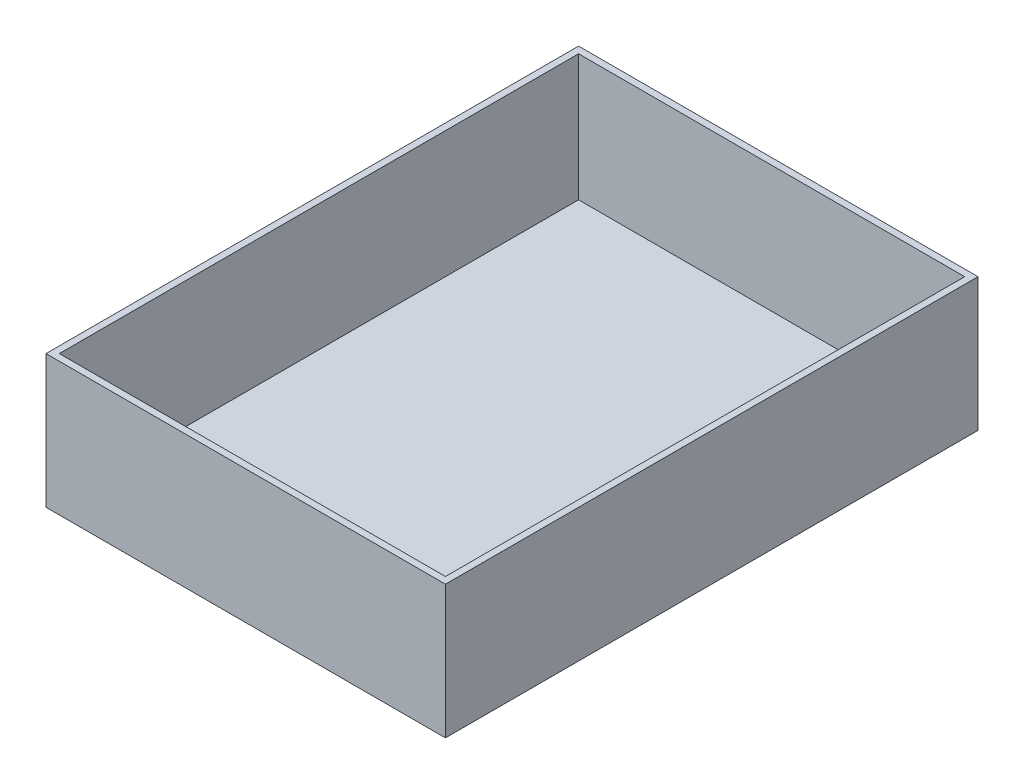
ISO-10303-21;
HEADER;
FILE_DESCRIPTION(('STEP AP214'),'2;1');
FILE_NAME('part.step','',(''),(''),'','','');
FILE_SCHEMA(('AUTOMOTIVE_DESIGN { 1 0 10303 214 1 1 1 1 }'));
ENDSEC;
DATA;
#1=APPLICATION_CONTEXT('core data for automotive mechanical design processes');
#2=APPLICATION_PROTOCOL_DEFINITION('international standard','automotive_design',2000,#1);
#3=PRODUCT_CONTEXT('',#1,'mechanical');
#4=PRODUCT('Part','Part','',(#3));
#5=PRODUCT_RELATED_PRODUCT_CATEGORY('part','',(#4));
#6=PRODUCT_DEFINITION_FORMATION('','',#4);
#7=PRODUCT_DEFINITION_CONTEXT('part definition',#1,'design');
#8=PRODUCT_DEFINITION('design','',#6,#7);
#9=PRODUCT_DEFINITION_SHAPE('','',#8);
#10=(LENGTH_UNIT() NAMED_UNIT(*) SI_UNIT(.MILLI.,.METRE.));
#11=(NAMED_UNIT(*) PLANE_ANGLE_UNIT() SI_UNIT($,.RADIAN.));
#12=(NAMED_UNIT(*) SI_UNIT($,.STERADIAN.) SOLID_ANGLE_UNIT());
#13=UNCERTAINTY_MEASURE_WITH_UNIT(LENGTH_MEASURE(1.E-05),#10,'distance_accuracy_value','');
#14=(GEOMETRIC_REPRESENTATION_CONTEXT(3) GLOBAL_UNCERTAINTY_ASSIGNED_CONTEXT((#13)) GLOBAL_UNIT_ASSIGNED_CONTEXT((#10,
#11,#12)) REPRESENTATION_CONTEXT('',''));
#15=CARTESIAN_POINT('',(0.,0.,0.));
#16=DIRECTION('',(0.,0.,1.));
#17=DIRECTION('',(1.,0.,0.));
#18=AXIS2_PLACEMENT_3D('',#15,#16,#17);
#19=CARTESIAN_POINT('',(75.,-25.,-200.));
#20=DIRECTION('',(1.,0.,0.));
#21=DIRECTION('',(0.,0.,-1.));
#22=AXIS2_PLACEMENT_3D('',#19,#20,#21);
#23=PLANE('',#22);
#24=DIRECTION('',(0.,1.,0.));
#25=VECTOR('',#24,1.);
#26=CARTESIAN_POINT('',(75.,-25.,0.));
#27=LINE('',#26,#25);
#28=CARTESIAN_POINT('',(75.,-25.,0.));
#29=VERTEX_POINT('',#28);
#30=CARTESIAN_POINT('',(75.,25.,0.));
#31=VERTEX_POINT('',#30);
#32=EDGE_CURVE('E142',#29,#31,#27,.T.);
#33=ORIENTED_EDGE('',*,*,#32,.F.);
#34=DIRECTION('',(0.,0.,1.));
#35=VECTOR('',#34,1.);
#36=CARTESIAN_POINT('',(75.,-25.,-200.));
#37=LINE('',#36,#35);
#38=CARTESIAN_POINT('',(75.,-25.,-200.));
#39=VERTEX_POINT('',#38);
#40=EDGE_CURVE('E11',#39,#29,#37,.T.);
#41=ORIENTED_EDGE('',*,*,#40,.F.);
#42=DIRECTION('',(0.,1.,0.));
#43=VECTOR('',#42,1.);
#44=CARTESIAN_POINT('',(75.,-25.,-200.));
#45=LINE('',#44,#43);
#46=CARTESIAN_POINT('',(75.,25.,-200.));
#47=VERTEX_POINT('',#46);
#48=EDGE_CURVE('E146',#39,#47,#45,.T.);
#49=ORIENTED_EDGE('',*,*,#48,.T.);
#50=DIRECTION('',(0.,0.,1.));
#51=VECTOR('',#50,1.);
#52=CARTESIAN_POINT('',(75.,25.,-200.));
#53=LINE('',#52,#51);
#54=EDGE_CURVE('E38',#47,#31,#53,.T.);
#55=ORIENTED_EDGE('',*,*,#54,.T.);
#56=EDGE_LOOP('',(#33,#41,#49,#55));
#57=FACE_BOUND('',#56,.T.);
#58=ADVANCED_FACE('F35',(#57),#23,.T.);
#59=CARTESIAN_POINT('',(-75.,-25.,-200.));
#60=DIRECTION('',(0.,-1.,0.));
#61=DIRECTION('',(0.,0.,-1.));
#62=AXIS2_PLACEMENT_3D('',#59,#60,#61);
#63=PLANE('',#62);
#64=DIRECTION('',(1.,0.,0.));
#65=VECTOR('',#64,1.);
#66=CARTESIAN_POINT('',(-75.,-25.,0.));
#67=LINE('',#66,#65);
#68=CARTESIAN_POINT('',(-75.,-25.,0.));
#69=VERTEX_POINT('',#68);
#70=EDGE_CURVE('E149',#69,#29,#67,.T.);
#71=ORIENTED_EDGE('',*,*,#70,.F.);
#72=DIRECTION('',(0.,0.,1.));
#73=VECTOR('',#72,1.);
#74=CARTESIAN_POINT('',(-75.,-25.,-200.));
#75=LINE('',#74,#73);
#76=CARTESIAN_POINT('',(-75.,-25.,-200.));
#77=VERTEX_POINT('',#76);
#78=EDGE_CURVE('E43',#77,#69,#75,.T.);
#79=ORIENTED_EDGE('',*,*,#78,.F.);
#80=DIRECTION('',(1.,0.,0.));
#81=VECTOR('',#80,1.);
#82=CARTESIAN_POINT('',(-75.,-25.,-200.));
#83=LINE('',#82,#81);
#84=EDGE_CURVE('E154',#77,#39,#83,.T.);
#85=ORIENTED_EDGE('',*,*,#84,.T.);
#86=ORIENTED_EDGE('',*,*,#40,.T.);
#87=EDGE_LOOP('',(#71,#79,#85,#86));
#88=FACE_BOUND('',#87,.T.);
#89=ADVANCED_FACE('F171',(#88),#63,.T.);
#90=CARTESIAN_POINT('',(-75.,-25.,-200.));
#91=DIRECTION('',(-1.,0.,0.));
#92=DIRECTION('',(0.,0.,1.));
#93=AXIS2_PLACEMENT_3D('',#90,#91,#92);
#94=PLANE('',#93);
#95=DIRECTION('',(0.,-1.,0.));
#96=VECTOR('',#95,1.);
#97=CARTESIAN_POINT('',(-75.,-25.,0.));
#98=LINE('',#97,#96);
#99=CARTESIAN_POINT('',(-75.,25.,0.));
#100=VERTEX_POINT('',#99);
#101=EDGE_CURVE('E161',#100,#69,#98,.T.);
#102=ORIENTED_EDGE('',*,*,#101,.F.);
#103=DIRECTION('',(0.,0.,1.));
#104=VECTOR('',#103,1.);
#105=CARTESIAN_POINT('',(-75.,25.,-200.));
#106=LINE('',#105,#104);
#107=CARTESIAN_POINT('',(-75.,25.,-200.));
#108=VERTEX_POINT('',#107);
#109=EDGE_CURVE('E166',#108,#100,#106,.T.);
#110=ORIENTED_EDGE('',*,*,#109,.F.);
#111=DIRECTION('',(0.,-1.,0.));
#112=VECTOR('',#111,1.);
#113=CARTESIAN_POINT('',(-75.,-25.,-200.));
#114=LINE('',#113,#112);
#115=EDGE_CURVE('E151',#108,#77,#114,.T.);
#116=ORIENTED_EDGE('',*,*,#115,.T.);
#117=ORIENTED_EDGE('',*,*,#78,.T.);
#118=EDGE_LOOP('',(#102,#110,#116,#117));
#119=FACE_BOUND('',#118,.T.);
#120=ADVANCED_FACE('F175',(#119),#94,.T.);
#121=CARTESIAN_POINT('',(-75.,25.,-200.));
#122=DIRECTION('',(0.,1.,0.));
#123=DIRECTION('',(0.,0.,1.));
#124=AXIS2_PLACEMENT_3D('',#121,#122,#123);
#125=PLANE('',#124);
#126=DIRECTION('',(0.,0.,1.));
#127=VECTOR('',#126,1.);
#128=CARTESIAN_POINT('',(-72.5,25.,-2.49999999999997));
#129=LINE('',#128,#127);
#130=CARTESIAN_POINT('',(-72.5,25.,-197.5));
#131=VERTEX_POINT('',#130);
#132=CARTESIAN_POINT('',(-72.5,25.,-2.49999999999997));
#133=VERTEX_POINT('',#132);
#134=EDGE_CURVE('E51',#131,#133,#129,.T.);
#135=ORIENTED_EDGE('',*,*,#134,.F.);
#136=DIRECTION('',(-1.,0.,0.));
#137=VECTOR('',#136,1.);
#138=CARTESIAN_POINT('',(72.5,25.,-197.5));
#139=LINE('',#138,#137);
#140=CARTESIAN_POINT('',(72.5,25.,-197.5));
#141=VERTEX_POINT('',#140);
#142=EDGE_CURVE('E127',#141,#131,#139,.T.);
#143=ORIENTED_EDGE('',*,*,#142,.F.);
#144=DIRECTION('',(0.,0.,-1.));
#145=VECTOR('',#144,1.);
#146=CARTESIAN_POINT('',(72.5,25.,-2.49999999999999));
#147=LINE('',#146,#145);
#148=CARTESIAN_POINT('',(72.5,25.,-2.49999999999999));
#149=VERTEX_POINT('',#148);
#150=EDGE_CURVE('E130',#149,#141,#147,.T.);
#151=ORIENTED_EDGE('',*,*,#150,.F.);
#152=DIRECTION('',(1.,0.,0.));
#153=VECTOR('',#152,1.);
#154=CARTESIAN_POINT('',(72.5,25.,-2.49999999999999));
#155=LINE('',#154,#153);
#156=EDGE_CURVE('E136',#133,#149,#155,.T.);
#157=ORIENTED_EDGE('',*,*,#156,.F.);
#158=EDGE_LOOP('',(#135,#143,#151,#157));
#159=FACE_BOUND('',#158,.T.);
#160=DIRECTION('',(-1.,0.,0.));
#161=VECTOR('',#160,1.);
#162=CARTESIAN_POINT('',(-75.,25.,0.));
#163=LINE('',#162,#161);
#164=EDGE_CURVE('E158',#31,#100,#163,.T.);
#165=ORIENTED_EDGE('',*,*,#164,.F.);
#166=ORIENTED_EDGE('',*,*,#54,.F.);
#167=DIRECTION('',(-1.,0.,0.));
#168=VECTOR('',#167,1.);
#169=CARTESIAN_POINT('',(-75.,25.,-200.));
#170=LINE('',#169,#168);
#171=EDGE_CURVE('E148',#47,#108,#170,.T.);
#172=ORIENTED_EDGE('',*,*,#171,.T.);
#173=ORIENTED_EDGE('',*,*,#109,.T.);
#174=EDGE_LOOP('',(#165,#166,#172,#173));
#175=FACE_BOUND('',#174,.T.);
#176=ADVANCED_FACE('F168',(#159,#175),#125,.T.);
#177=CARTESIAN_POINT('',(0.,0.,-200.));
#178=DIRECTION('',(0.,0.,-1.));
#179=DIRECTION('',(-1.,0.,0.));
#180=AXIS2_PLACEMENT_3D('',#177,#178,#179);
#181=PLANE('',#180);
#182=ORIENTED_EDGE('',*,*,#48,.F.);
#183=ORIENTED_EDGE('',*,*,#84,.F.);
#184=ORIENTED_EDGE('',*,*,#115,.F.);
#185=ORIENTED_EDGE('',*,*,#171,.F.);
#186=EDGE_LOOP('',(#182,#183,#184,#185));
#187=FACE_BOUND('',#186,.T.);
#188=ADVANCED_FACE('F177',(#187),#181,.T.);
#189=CARTESIAN_POINT('',(0.,0.,0.));
#190=DIRECTION('',(0.,0.,-1.));
#191=DIRECTION('',(-1.,0.,0.));
#192=AXIS2_PLACEMENT_3D('',#189,#190,#191);
#193=PLANE('',#192);
#194=ORIENTED_EDGE('',*,*,#32,.T.);
#195=ORIENTED_EDGE('',*,*,#164,.T.);
#196=ORIENTED_EDGE('',*,*,#101,.T.);
#197=ORIENTED_EDGE('',*,*,#70,.T.);
#198=EDGE_LOOP('',(#194,#195,#196,#197));
#199=FACE_BOUND('',#198,.T.);
#200=ADVANCED_FACE('F170',(#199),#193,.F.);
#201=CARTESIAN_POINT('',(-72.5,-22.5,-2.49999999999997));
#202=DIRECTION('',(-1.,0.,0.));
#203=DIRECTION('',(0.,0.,1.));
#204=AXIS2_PLACEMENT_3D('',#201,#202,#203);
#205=PLANE('',#204);
#206=ORIENTED_EDGE('',*,*,#134,.T.);
#207=DIRECTION('',(0.,1.,0.));
#208=VECTOR('',#207,1.);
#209=CARTESIAN_POINT('',(-72.5,-22.5,-2.49999999999997));
#210=LINE('',#209,#208);
#211=CARTESIAN_POINT('',(-72.5,-22.5,-2.49999999999997));
#212=VERTEX_POINT('',#211);
#213=EDGE_CURVE('E105',#212,#133,#210,.T.);
#214=ORIENTED_EDGE('',*,*,#213,.F.);
#215=DIRECTION('',(0.,0.,1.));
#216=VECTOR('',#215,1.);
#217=CARTESIAN_POINT('',(-72.5,-22.5,-2.49999999999997));
#218=LINE('',#217,#216);
#219=CARTESIAN_POINT('',(-72.5,-22.5,-197.5));
#220=VERTEX_POINT('',#219);
#221=EDGE_CURVE('E109',#220,#212,#218,.T.);
#222=ORIENTED_EDGE('',*,*,#221,.F.);
#223=DIRECTION('',(0.,1.,0.));
#224=VECTOR('',#223,1.);
#225=CARTESIAN_POINT('',(-72.5,-22.5,-197.5));
#226=LINE('',#225,#224);
#227=EDGE_CURVE('E140',#220,#131,#226,.T.);
#228=ORIENTED_EDGE('',*,*,#227,.T.);
#229=EDGE_LOOP('',(#206,#214,#222,#228));
#230=FACE_BOUND('',#229,.T.);
#231=ADVANCED_FACE('F107',(#230),#205,.F.);
#232=CARTESIAN_POINT('',(72.5,-22.5,-197.5));
#233=DIRECTION('',(0.,0.,-1.));
#234=DIRECTION('',(-1.,0.,0.));
#235=AXIS2_PLACEMENT_3D('',#232,#233,#234);
#236=PLANE('',#235);
#237=ORIENTED_EDGE('',*,*,#142,.T.);
#238=ORIENTED_EDGE('',*,*,#227,.F.);
#239=DIRECTION('',(-1.,0.,0.));
#240=VECTOR('',#239,1.);
#241=CARTESIAN_POINT('',(72.5,-22.5,-197.5));
#242=LINE('',#241,#240);
#243=CARTESIAN_POINT('',(72.5,-22.5,-197.5));
#244=VERTEX_POINT('',#243);
#245=EDGE_CURVE('E115',#244,#220,#242,.T.);
#246=ORIENTED_EDGE('',*,*,#245,.F.);
#247=DIRECTION('',(0.,1.,0.));
#248=VECTOR('',#247,1.);
#249=CARTESIAN_POINT('',(72.5,-22.5,-197.5));
#250=LINE('',#249,#248);
#251=EDGE_CURVE('E143',#244,#141,#250,.T.);
#252=ORIENTED_EDGE('',*,*,#251,.T.);
#253=EDGE_LOOP('',(#237,#238,#246,#252));
#254=FACE_BOUND('',#253,.T.);
#255=ADVANCED_FACE('F215',(#254),#236,.F.);
#256=CARTESIAN_POINT('',(72.5,-22.5,-2.49999999999999));
#257=DIRECTION('',(1.,0.,0.));
#258=DIRECTION('',(0.,0.,-1.));
#259=AXIS2_PLACEMENT_3D('',#256,#257,#258);
#260=PLANE('',#259);
#261=ORIENTED_EDGE('',*,*,#150,.T.);
#262=ORIENTED_EDGE('',*,*,#251,.F.);
#263=DIRECTION('',(0.,0.,-1.));
#264=VECTOR('',#263,1.);
#265=CARTESIAN_POINT('',(72.5,-22.5,-2.49999999999999));
#266=LINE('',#265,#264);
#267=CARTESIAN_POINT('',(72.5,-22.5,-2.49999999999999));
#268=VERTEX_POINT('',#267);
#269=EDGE_CURVE('E123',#268,#244,#266,.T.);
#270=ORIENTED_EDGE('',*,*,#269,.F.);
#271=DIRECTION('',(0.,1.,0.));
#272=VECTOR('',#271,1.);
#273=CARTESIAN_POINT('',(72.5,-22.5,-2.49999999999999));
#274=LINE('',#273,#272);
#275=EDGE_CURVE('E114',#268,#149,#274,.T.);
#276=ORIENTED_EDGE('',*,*,#275,.T.);
#277=EDGE_LOOP('',(#261,#262,#270,#276));
#278=FACE_BOUND('',#277,.T.);
#279=ADVANCED_FACE('F223',(#278),#260,.F.);
#280=CARTESIAN_POINT('',(72.5,-22.5,-2.49999999999999));
#281=DIRECTION('',(0.,0.,1.));
#282=DIRECTION('',(1.,0.,0.));
#283=AXIS2_PLACEMENT_3D('',#280,#281,#282);
#284=PLANE('',#283);
#285=ORIENTED_EDGE('',*,*,#156,.T.);
#286=ORIENTED_EDGE('',*,*,#275,.F.);
#287=DIRECTION('',(1.,0.,0.));
#288=VECTOR('',#287,1.);
#289=CARTESIAN_POINT('',(72.5,-22.5,-2.49999999999999));
#290=LINE('',#289,#288);
#291=EDGE_CURVE('E118',#212,#268,#290,.T.);
#292=ORIENTED_EDGE('',*,*,#291,.F.);
#293=ORIENTED_EDGE('',*,*,#213,.T.);
#294=EDGE_LOOP('',(#285,#286,#292,#293));
#295=FACE_BOUND('',#294,.T.);
#296=ADVANCED_FACE('F119',(#295),#284,.F.);
#297=CARTESIAN_POINT('',(0.,-22.5,0.));
#298=DIRECTION('',(0.,1.,0.));
#299=DIRECTION('',(0.,0.,1.));
#300=AXIS2_PLACEMENT_3D('',#297,#298,#299);
#301=PLANE('',#300);
#302=ORIENTED_EDGE('',*,*,#221,.T.);
#303=ORIENTED_EDGE('',*,*,#291,.T.);
#304=ORIENTED_EDGE('',*,*,#269,.T.);
#305=ORIENTED_EDGE('',*,*,#245,.T.);
#306=EDGE_LOOP('',(#302,#303,#304,#305));
#307=FACE_BOUND('',#306,.T.);
#308=ADVANCED_FACE('F125',(#307),#301,.T.);
#309=CLOSED_SHELL('',(#58,#89,#120,#176,#188,#200,#231,#255,#279,#296,#308));
#310=MANIFOLD_SOLID_BREP('B2',#309);
#311=ADVANCED_BREP_SHAPE_REPRESENTATION('',(#18,#310),#14);
#312=SHAPE_DEFINITION_REPRESENTATION(#9,#311);
ENDSEC;
END-ISO-10303-21;
